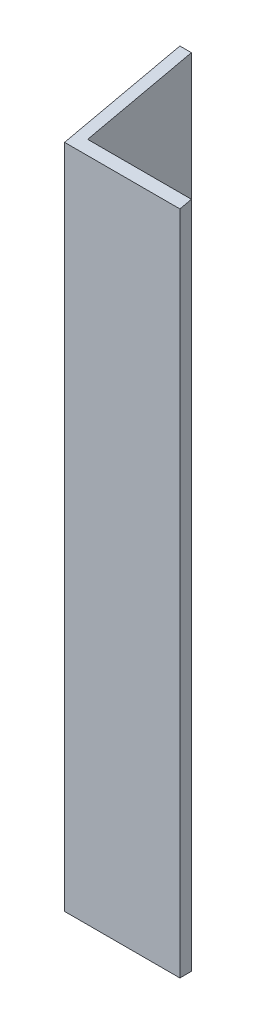
ISO-10303-21;
HEADER;
FILE_DESCRIPTION(('STEP AP214'),'2;1');
FILE_NAME('part.step','',(''),(''),'','','');
FILE_SCHEMA(('AUTOMOTIVE_DESIGN { 1 0 10303 214 1 1 1 1 }'));
ENDSEC;
DATA;
#1=APPLICATION_CONTEXT('core data for automotive mechanical design processes');
#2=APPLICATION_PROTOCOL_DEFINITION('international standard','automotive_design',2000,#1);
#3=PRODUCT_CONTEXT('',#1,'mechanical');
#4=PRODUCT('Part','Part','',(#3));
#5=PRODUCT_RELATED_PRODUCT_CATEGORY('part','',(#4));
#6=PRODUCT_DEFINITION_FORMATION('','',#4);
#7=PRODUCT_DEFINITION_CONTEXT('part definition',#1,'design');
#8=PRODUCT_DEFINITION('design','',#6,#7);
#9=PRODUCT_DEFINITION_SHAPE('','',#8);
#10=(LENGTH_UNIT() NAMED_UNIT(*) SI_UNIT(.MILLI.,.METRE.));
#11=(NAMED_UNIT(*) PLANE_ANGLE_UNIT() SI_UNIT($,.RADIAN.));
#12=(NAMED_UNIT(*) SI_UNIT($,.STERADIAN.) SOLID_ANGLE_UNIT());
#13=UNCERTAINTY_MEASURE_WITH_UNIT(LENGTH_MEASURE(1.E-05),#10,'distance_accuracy_value','');
#14=(GEOMETRIC_REPRESENTATION_CONTEXT(3) GLOBAL_UNCERTAINTY_ASSIGNED_CONTEXT((#13)) GLOBAL_UNIT_ASSIGNED_CONTEXT((#10,
#11,#12)) REPRESENTATION_CONTEXT('',''));
#15=CARTESIAN_POINT('',(0.,0.,0.));
#16=DIRECTION('',(0.,0.,1.));
#17=DIRECTION('',(1.,0.,0.));
#18=AXIS2_PLACEMENT_3D('',#15,#16,#17);
#19=CARTESIAN_POINT('',(16.7727272727273,4.20454545454545,-20.));
#20=DIRECTION('',(1.,0.,0.));
#21=DIRECTION('',(0.,1.,0.));
#22=AXIS2_PLACEMENT_3D('',#19,#20,#21);
#23=PLANE('',#22);
#24=DIRECTION('',(0.,0.,1.));
#25=VECTOR('',#24,1.);
#26=CARTESIAN_POINT('',(16.7727272727273,-115.795454545455,-20.));
#27=LINE('',#26,#25);
#28=CARTESIAN_POINT('',(16.7727272727273,-115.795454545455,-2.));
#29=VERTEX_POINT('',#28);
#30=CARTESIAN_POINT('',(16.7727272727273,-115.795454545455,0.));
#31=VERTEX_POINT('',#30);
#32=EDGE_CURVE('E127',#29,#31,#27,.T.);
#33=ORIENTED_EDGE('',*,*,#32,.F.);
#34=DIRECTION('',(0.,-1.,0.));
#35=VECTOR('',#34,1.);
#36=CARTESIAN_POINT('',(16.7727272727273,4.20454545454545,-2.));
#37=LINE('',#36,#35);
#38=CARTESIAN_POINT('',(16.7727272727273,0.18106876239674,-2.));
#39=VERTEX_POINT('',#38);
#40=EDGE_CURVE('E95',#39,#29,#37,.T.);
#41=ORIENTED_EDGE('',*,*,#40,.F.);
#42=DIRECTION('',(0.,-0.218143241396544,0.975916761938747));
#43=VECTOR('',#42,1.);
#44=CARTESIAN_POINT('',(16.7727272727273,4.20454545454545,-20.));
#45=LINE('',#44,#43);
#46=CARTESIAN_POINT('',(16.7727272727273,-0.265984203397561,0.));
#47=VERTEX_POINT('',#46);
#48=EDGE_CURVE('E107',#39,#47,#45,.T.);
#49=ORIENTED_EDGE('',*,*,#48,.T.);
#50=DIRECTION('',(0.,1.,0.));
#51=VECTOR('',#50,1.);
#52=CARTESIAN_POINT('',(16.7727272727273,4.20454545454545,0.));
#53=LINE('',#52,#51);
#54=EDGE_CURVE('E116',#31,#47,#53,.T.);
#55=ORIENTED_EDGE('',*,*,#54,.F.);
#56=EDGE_LOOP('',(#33,#41,#49,#55));
#57=FACE_BOUND('',#56,.T.);
#58=ADVANCED_FACE('F32',(#57),#23,.T.);
#59=CARTESIAN_POINT('',(-3.22727272727271,-115.795454545455,-20.));
#60=DIRECTION('',(0.,-1.,0.));
#61=DIRECTION('',(0.,0.,-1.));
#62=AXIS2_PLACEMENT_3D('',#59,#60,#61);
#63=PLANE('',#62);
#64=DIRECTION('',(0.,0.,1.));
#65=VECTOR('',#64,1.);
#66=CARTESIAN_POINT('',(-1.22727272727271,-115.795454545455,0.));
#67=LINE('',#66,#65);
#68=CARTESIAN_POINT('',(-1.22727272727271,-115.795454545455,-20.));
#69=VERTEX_POINT('',#68);
#70=CARTESIAN_POINT('',(-1.22727272727271,-115.795454545455,-2.));
#71=VERTEX_POINT('',#70);
#72=EDGE_CURVE('E87',#69,#71,#67,.T.);
#73=ORIENTED_EDGE('',*,*,#72,.T.);
#74=DIRECTION('',(1.,0.,0.));
#75=VECTOR('',#74,1.);
#76=CARTESIAN_POINT('',(0.,-115.795454545455,-2.));
#77=LINE('',#76,#75);
#78=EDGE_CURVE('E92',#71,#29,#77,.T.);
#79=ORIENTED_EDGE('',*,*,#78,.T.);
#80=ORIENTED_EDGE('',*,*,#32,.T.);
#81=DIRECTION('',(1.,0.,0.));
#82=VECTOR('',#81,1.);
#83=CARTESIAN_POINT('',(-3.22727272727271,-115.795454545455,0.));
#84=LINE('',#83,#82);
#85=CARTESIAN_POINT('',(-3.22727272727271,-115.795454545455,0.));
#86=VERTEX_POINT('',#85);
#87=EDGE_CURVE('E122',#86,#31,#84,.T.);
#88=ORIENTED_EDGE('',*,*,#87,.F.);
#89=DIRECTION('',(0.,0.,1.));
#90=VECTOR('',#89,1.);
#91=CARTESIAN_POINT('',(-3.22727272727271,-115.795454545455,-20.));
#92=LINE('',#91,#90);
#93=CARTESIAN_POINT('',(-3.22727272727271,-115.795454545455,-20.));
#94=VERTEX_POINT('',#93);
#95=EDGE_CURVE('E120',#94,#86,#92,.T.);
#96=ORIENTED_EDGE('',*,*,#95,.F.);
#97=DIRECTION('',(1.,0.,0.));
#98=VECTOR('',#97,1.);
#99=CARTESIAN_POINT('',(-3.22727272727271,-115.795454545455,-20.));
#100=LINE('',#99,#98);
#101=EDGE_CURVE('E102',#94,#69,#100,.T.);
#102=ORIENTED_EDGE('',*,*,#101,.T.);
#103=EDGE_LOOP('',(#73,#79,#80,#88,#96,#102));
#104=FACE_BOUND('',#103,.T.);
#105=ADVANCED_FACE('F100',(#104),#63,.T.);
#106=CARTESIAN_POINT('',(0.,0.,-20.));
#107=DIRECTION('',(0.,0.,1.));
#108=DIRECTION('',(1.,0.,0.));
#109=AXIS2_PLACEMENT_3D('',#106,#107,#108);
#110=PLANE('',#109);
#111=DIRECTION('',(0.,-1.,0.));
#112=VECTOR('',#111,1.);
#113=CARTESIAN_POINT('',(-1.22727272727271,4.20454545454545,-20.));
#114=LINE('',#113,#112);
#115=CARTESIAN_POINT('',(-1.22727272727271,4.20454545454545,-20.));
#116=VERTEX_POINT('',#115);
#117=EDGE_CURVE('E47',#116,#69,#114,.T.);
#118=ORIENTED_EDGE('',*,*,#117,.T.);
#119=ORIENTED_EDGE('',*,*,#101,.F.);
#120=DIRECTION('',(0.,-1.,0.));
#121=VECTOR('',#120,1.);
#122=CARTESIAN_POINT('',(-3.22727272727272,4.20454545454545,-20.));
#123=LINE('',#122,#121);
#124=CARTESIAN_POINT('',(-3.22727272727272,4.20454545454545,-20.));
#125=VERTEX_POINT('',#124);
#126=EDGE_CURVE('E113',#125,#94,#123,.T.);
#127=ORIENTED_EDGE('',*,*,#126,.F.);
#128=DIRECTION('',(-1.,0.,0.));
#129=VECTOR('',#128,1.);
#130=CARTESIAN_POINT('',(-3.22727272727272,4.20454545454545,-20.));
#131=LINE('',#130,#129);
#132=EDGE_CURVE('E118',#116,#125,#131,.T.);
#133=ORIENTED_EDGE('',*,*,#132,.F.);
#134=EDGE_LOOP('',(#118,#119,#127,#133));
#135=FACE_BOUND('',#134,.T.);
#136=ADVANCED_FACE('F145',(#135),#110,.F.);
#137=CARTESIAN_POINT('',(16.7727272727273,4.20454545454545,-20.));
#138=DIRECTION('',(0.,-0.975916761938747,-0.218143241396544));
#139=DIRECTION('',(0.,0.218143241396544,-0.975916761938747));
#140=AXIS2_PLACEMENT_3D('',#137,#138,#139);
#141=PLANE('',#140);
#142=DIRECTION('',(1.,0.,0.));
#143=VECTOR('',#142,1.);
#144=CARTESIAN_POINT('',(16.7727272727273,0.18106876239674,-2.));
#145=LINE('',#144,#143);
#146=CARTESIAN_POINT('',(-1.22727272727271,0.181068762396737,-2.));
#147=VERTEX_POINT('',#146);
#148=EDGE_CURVE('E11',#147,#39,#145,.T.);
#149=ORIENTED_EDGE('',*,*,#148,.F.);
#150=DIRECTION('',(0.,-0.218143241396544,0.975916761938747));
#151=VECTOR('',#150,1.);
#152=CARTESIAN_POINT('',(-1.22727272727271,4.20454545454545,-20.));
#153=LINE('',#152,#151);
#154=EDGE_CURVE('E40',#116,#147,#153,.T.);
#155=ORIENTED_EDGE('',*,*,#154,.F.);
#156=ORIENTED_EDGE('',*,*,#132,.T.);
#157=DIRECTION('',(0.,-0.218143241396544,0.975916761938747));
#158=VECTOR('',#157,1.);
#159=CARTESIAN_POINT('',(-3.22727272727272,4.20454545454545,-20.));
#160=LINE('',#159,#158);
#161=CARTESIAN_POINT('',(-3.22727272727272,-0.265984203397564,0.));
#162=VERTEX_POINT('',#161);
#163=EDGE_CURVE('E55',#125,#162,#160,.T.);
#164=ORIENTED_EDGE('',*,*,#163,.T.);
#165=DIRECTION('',(-1.,0.,0.));
#166=VECTOR('',#165,1.);
#167=CARTESIAN_POINT('',(16.7727272727273,-0.265984203397561,0.));
#168=LINE('',#167,#166);
#169=EDGE_CURVE('E109',#47,#162,#168,.T.);
#170=ORIENTED_EDGE('',*,*,#169,.F.);
#171=ORIENTED_EDGE('',*,*,#48,.F.);
#172=EDGE_LOOP('',(#149,#155,#156,#164,#170,#171));
#173=FACE_BOUND('',#172,.T.);
#174=ADVANCED_FACE('F138',(#173),#141,.F.);
#175=CARTESIAN_POINT('',(-3.22727272727272,4.20454545454545,-20.));
#176=DIRECTION('',(-1.,0.,0.));
#177=DIRECTION('',(0.,-1.,0.));
#178=AXIS2_PLACEMENT_3D('',#175,#176,#177);
#179=PLANE('',#178);
#180=ORIENTED_EDGE('',*,*,#163,.F.);
#181=ORIENTED_EDGE('',*,*,#126,.T.);
#182=ORIENTED_EDGE('',*,*,#95,.T.);
#183=DIRECTION('',(0.,-1.,0.));
#184=VECTOR('',#183,1.);
#185=CARTESIAN_POINT('',(-3.22727272727272,4.20454545454545,0.));
#186=LINE('',#185,#184);
#187=EDGE_CURVE('E112',#162,#86,#186,.T.);
#188=ORIENTED_EDGE('',*,*,#187,.F.);
#189=EDGE_LOOP('',(#180,#181,#182,#188));
#190=FACE_BOUND('',#189,.T.);
#191=ADVANCED_FACE('F34',(#190),#179,.T.);
#192=CARTESIAN_POINT('',(0.,0.,0.));
#193=DIRECTION('',(0.,0.,1.));
#194=DIRECTION('',(1.,0.,0.));
#195=AXIS2_PLACEMENT_3D('',#192,#193,#194);
#196=PLANE('',#195);
#197=ORIENTED_EDGE('',*,*,#169,.T.);
#198=ORIENTED_EDGE('',*,*,#187,.T.);
#199=ORIENTED_EDGE('',*,*,#87,.T.);
#200=ORIENTED_EDGE('',*,*,#54,.T.);
#201=EDGE_LOOP('',(#197,#198,#199,#200));
#202=FACE_BOUND('',#201,.T.);
#203=ADVANCED_FACE('F136',(#202),#196,.T.);
#204=CARTESIAN_POINT('',(0.,4.20454545454545,-2.));
#205=DIRECTION('',(0.,0.,-1.));
#206=DIRECTION('',(-1.,0.,0.));
#207=AXIS2_PLACEMENT_3D('',#204,#205,#206);
#208=PLANE('',#207);
#209=ORIENTED_EDGE('',*,*,#148,.T.);
#210=ORIENTED_EDGE('',*,*,#40,.T.);
#211=ORIENTED_EDGE('',*,*,#78,.F.);
#212=DIRECTION('',(0.,-1.,0.));
#213=VECTOR('',#212,1.);
#214=CARTESIAN_POINT('',(-1.22727272727271,4.20454545454545,-2.));
#215=LINE('',#214,#213);
#216=EDGE_CURVE('E83',#147,#71,#215,.T.);
#217=ORIENTED_EDGE('',*,*,#216,.F.);
#218=EDGE_LOOP('',(#209,#210,#211,#217));
#219=FACE_BOUND('',#218,.T.);
#220=ADVANCED_FACE('F93',(#219),#208,.T.);
#221=CARTESIAN_POINT('',(-1.22727272727271,4.20454545454545,0.));
#222=DIRECTION('',(1.,0.,0.));
#223=DIRECTION('',(0.,0.,-1.));
#224=AXIS2_PLACEMENT_3D('',#221,#222,#223);
#225=PLANE('',#224);
#226=ORIENTED_EDGE('',*,*,#154,.T.);
#227=ORIENTED_EDGE('',*,*,#216,.T.);
#228=ORIENTED_EDGE('',*,*,#72,.F.);
#229=ORIENTED_EDGE('',*,*,#117,.F.);
#230=EDGE_LOOP('',(#226,#227,#228,#229));
#231=FACE_BOUND('',#230,.T.);
#232=ADVANCED_FACE('F85',(#231),#225,.T.);
#233=CLOSED_SHELL('',(#58,#105,#136,#174,#191,#203,#220,#232));
#234=MANIFOLD_SOLID_BREP('B2',#233);
#235=ADVANCED_BREP_SHAPE_REPRESENTATION('',(#18,#234),#14);
#236=SHAPE_DEFINITION_REPRESENTATION(#9,#235);
ENDSEC;
END-ISO-10303-21;
